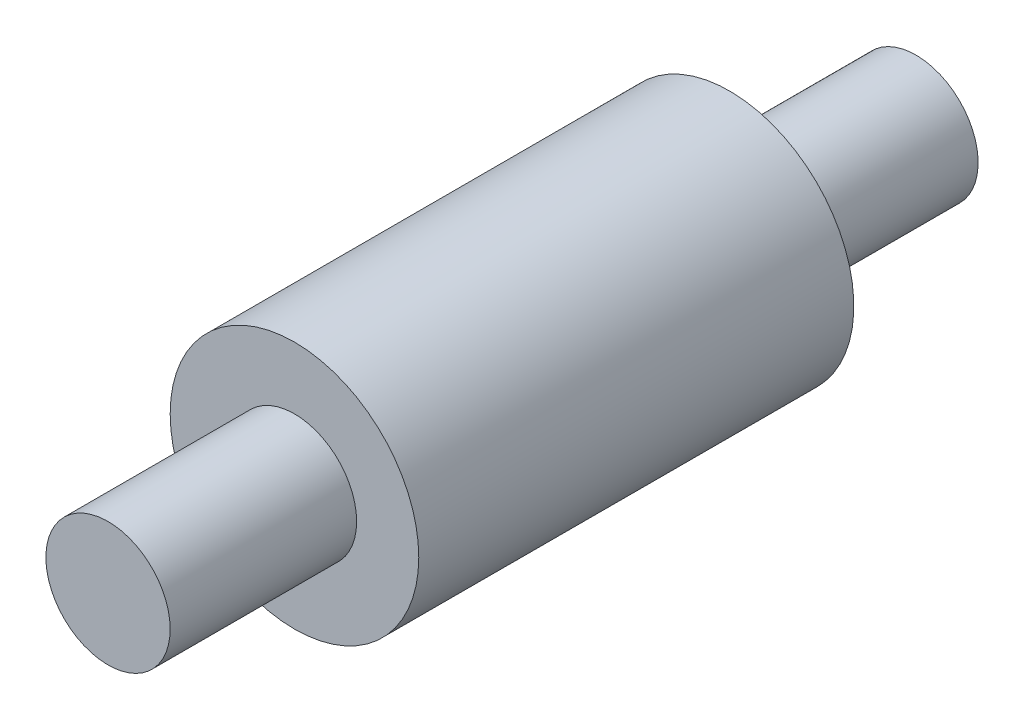
ISO-10303-21;
HEADER;
FILE_DESCRIPTION(('STEP AP214'),'2;1');
FILE_NAME('part.step','',(''),(''),'','','');
FILE_SCHEMA(('AUTOMOTIVE_DESIGN { 1 0 10303 214 1 1 1 1 }'));
ENDSEC;
DATA;
#1=APPLICATION_CONTEXT('core data for automotive mechanical design processes');
#2=APPLICATION_PROTOCOL_DEFINITION('international standard','automotive_design',2000,#1);
#3=PRODUCT_CONTEXT('',#1,'mechanical');
#4=PRODUCT('Part','Part','',(#3));
#5=PRODUCT_RELATED_PRODUCT_CATEGORY('part','',(#4));
#6=PRODUCT_DEFINITION_FORMATION('','',#4);
#7=PRODUCT_DEFINITION_CONTEXT('part definition',#1,'design');
#8=PRODUCT_DEFINITION('design','',#6,#7);
#9=PRODUCT_DEFINITION_SHAPE('','',#8);
#10=(LENGTH_UNIT() NAMED_UNIT(*) SI_UNIT(.MILLI.,.METRE.));
#11=(NAMED_UNIT(*) PLANE_ANGLE_UNIT() SI_UNIT($,.RADIAN.));
#12=(NAMED_UNIT(*) SI_UNIT($,.STERADIAN.) SOLID_ANGLE_UNIT());
#13=UNCERTAINTY_MEASURE_WITH_UNIT(LENGTH_MEASURE(1.E-05),#10,'distance_accuracy_value','');
#14=(GEOMETRIC_REPRESENTATION_CONTEXT(3) GLOBAL_UNCERTAINTY_ASSIGNED_CONTEXT((#13)) GLOBAL_UNIT_ASSIGNED_CONTEXT((#10,
#11,#12)) REPRESENTATION_CONTEXT('',''));
#15=CARTESIAN_POINT('',(0.,0.,0.));
#16=DIRECTION('',(0.,0.,1.));
#17=DIRECTION('',(1.,0.,0.));
#18=AXIS2_PLACEMENT_3D('',#15,#16,#17);
#19=CARTESIAN_POINT('',(0.,0.,130.));
#20=DIRECTION('',(0.,0.,-1.));
#21=DIRECTION('',(-1.,0.,0.));
#22=AXIS2_PLACEMENT_3D('',#19,#20,#21);
#23=CYLINDRICAL_SURFACE('',#22,20.);
#24=CARTESIAN_POINT('',(0.,0.,100.));
#25=DIRECTION('',(0.,0.,1.));
#26=DIRECTION('',(1.,0.,0.));
#27=AXIS2_PLACEMENT_3D('',#24,#25,#26);
#28=CIRCLE('',#27,20.);
#29=CARTESIAN_POINT('',(20.,0.,100.));
#30=VERTEX_POINT('',#29);
#31=EDGE_CURVE('E11',#30,#30,#28,.T.);
#32=ORIENTED_EDGE('',*,*,#31,.F.);
#33=EDGE_LOOP('',(#32));
#34=FACE_BOUND('',#33,.T.);
#35=CARTESIAN_POINT('',(0.,0.,30.));
#36=DIRECTION('',(0.,0.,-1.));
#37=DIRECTION('',(-1.,0.,0.));
#38=AXIS2_PLACEMENT_3D('',#35,#36,#37);
#39=CIRCLE('',#38,20.);
#40=CARTESIAN_POINT('',(-20.,0.,30.));
#41=VERTEX_POINT('',#40);
#42=EDGE_CURVE('E36',#41,#41,#39,.T.);
#43=ORIENTED_EDGE('',*,*,#42,.F.);
#44=EDGE_LOOP('',(#43));
#45=FACE_BOUND('',#44,.T.);
#46=ADVANCED_FACE('F33',(#34,#45),#23,.T.);
#47=CARTESIAN_POINT('',(0.,0.,100.));
#48=DIRECTION('',(0.,0.,1.));
#49=DIRECTION('',(1.,0.,0.));
#50=AXIS2_PLACEMENT_3D('',#47,#48,#49);
#51=PLANE('',#50);
#52=CARTESIAN_POINT('',(0.,0.,100.));
#53=DIRECTION('',(0.,0.,1.));
#54=DIRECTION('',(1.,0.,0.));
#55=AXIS2_PLACEMENT_3D('',#52,#53,#54);
#56=CIRCLE('',#55,10.);
#57=CARTESIAN_POINT('',(10.,0.,100.));
#58=VERTEX_POINT('',#57);
#59=EDGE_CURVE('E40',#58,#58,#56,.T.);
#60=ORIENTED_EDGE('',*,*,#59,.F.);
#61=EDGE_LOOP('',(#60));
#62=FACE_BOUND('',#61,.T.);
#63=ORIENTED_EDGE('',*,*,#31,.T.);
#64=EDGE_LOOP('',(#63));
#65=FACE_BOUND('',#64,.T.);
#66=ADVANCED_FACE('F62',(#62,#65),#51,.T.);
#67=CARTESIAN_POINT('',(0.,0.,100.));
#68=DIRECTION('',(0.,0.,1.));
#69=DIRECTION('',(1.,0.,0.));
#70=AXIS2_PLACEMENT_3D('',#67,#68,#69);
#71=CYLINDRICAL_SURFACE('',#70,10.);
#72=ORIENTED_EDGE('',*,*,#59,.T.);
#73=EDGE_LOOP('',(#72));
#74=FACE_BOUND('',#73,.T.);
#75=CARTESIAN_POINT('',(0.,0.,130.));
#76=DIRECTION('',(0.,0.,1.));
#77=DIRECTION('',(1.,0.,0.));
#78=AXIS2_PLACEMENT_3D('',#75,#76,#77);
#79=CIRCLE('',#78,10.);
#80=CARTESIAN_POINT('',(10.,0.,130.));
#81=VERTEX_POINT('',#80);
#82=EDGE_CURVE('E44',#81,#81,#79,.T.);
#83=ORIENTED_EDGE('',*,*,#82,.F.);
#84=EDGE_LOOP('',(#83));
#85=FACE_BOUND('',#84,.T.);
#86=ADVANCED_FACE('F67',(#74,#85),#71,.T.);
#87=CARTESIAN_POINT('',(0.,0.,130.));
#88=DIRECTION('',(0.,0.,1.));
#89=DIRECTION('',(1.,0.,0.));
#90=AXIS2_PLACEMENT_3D('',#87,#88,#89);
#91=PLANE('',#90);
#92=ORIENTED_EDGE('',*,*,#82,.T.);
#93=EDGE_LOOP('',(#92));
#94=FACE_BOUND('',#93,.T.);
#95=ADVANCED_FACE('F73',(#94),#91,.T.);
#96=CARTESIAN_POINT('',(0.,0.,30.));
#97=DIRECTION('',(0.,0.,-1.));
#98=DIRECTION('',(-1.,0.,0.));
#99=AXIS2_PLACEMENT_3D('',#96,#97,#98);
#100=PLANE('',#99);
#101=CARTESIAN_POINT('',(0.,0.,30.));
#102=DIRECTION('',(0.,0.,-1.));
#103=DIRECTION('',(-1.,0.,0.));
#104=AXIS2_PLACEMENT_3D('',#101,#102,#103);
#105=CIRCLE('',#104,10.);
#106=CARTESIAN_POINT('',(-10.,0.,30.));
#107=VERTEX_POINT('',#106);
#108=EDGE_CURVE('E52',#107,#107,#105,.T.);
#109=ORIENTED_EDGE('',*,*,#108,.F.);
#110=EDGE_LOOP('',(#109));
#111=FACE_BOUND('',#110,.T.);
#112=ORIENTED_EDGE('',*,*,#42,.T.);
#113=EDGE_LOOP('',(#112));
#114=FACE_BOUND('',#113,.T.);
#115=ADVANCED_FACE('F59',(#111,#114),#100,.T.);
#116=CARTESIAN_POINT('',(0.,0.,30.));
#117=DIRECTION('',(0.,0.,-1.));
#118=DIRECTION('',(-1.,0.,0.));
#119=AXIS2_PLACEMENT_3D('',#116,#117,#118);
#120=CYLINDRICAL_SURFACE('',#119,10.);
#121=ORIENTED_EDGE('',*,*,#108,.T.);
#122=EDGE_LOOP('',(#121));
#123=FACE_BOUND('',#122,.T.);
#124=CARTESIAN_POINT('',(0.,0.,0.));
#125=DIRECTION('',(0.,0.,-1.));
#126=DIRECTION('',(-1.,0.,0.));
#127=AXIS2_PLACEMENT_3D('',#124,#125,#126);
#128=CIRCLE('',#127,10.);
#129=CARTESIAN_POINT('',(-10.,0.,0.));
#130=VERTEX_POINT('',#129);
#131=EDGE_CURVE('E49',#130,#130,#128,.T.);
#132=ORIENTED_EDGE('',*,*,#131,.F.);
#133=EDGE_LOOP('',(#132));
#134=FACE_BOUND('',#133,.T.);
#135=ADVANCED_FACE('F83',(#123,#134),#120,.T.);
#136=CARTESIAN_POINT('',(0.,0.,0.));
#137=DIRECTION('',(0.,0.,1.));
#138=DIRECTION('',(1.,0.,0.));
#139=AXIS2_PLACEMENT_3D('',#136,#137,#138);
#140=PLANE('',#139);
#141=ORIENTED_EDGE('',*,*,#131,.T.);
#142=EDGE_LOOP('',(#141));
#143=FACE_BOUND('',#142,.T.);
#144=ADVANCED_FACE('F81',(#143),#140,.F.);
#145=CLOSED_SHELL('',(#46,#66,#86,#95,#115,#135,#144));
#146=MANIFOLD_SOLID_BREP('B2',#145);
#147=ADVANCED_BREP_SHAPE_REPRESENTATION('',(#18,#146),#14);
#148=SHAPE_DEFINITION_REPRESENTATION(#9,#147);
ENDSEC;
END-ISO-10303-21;
